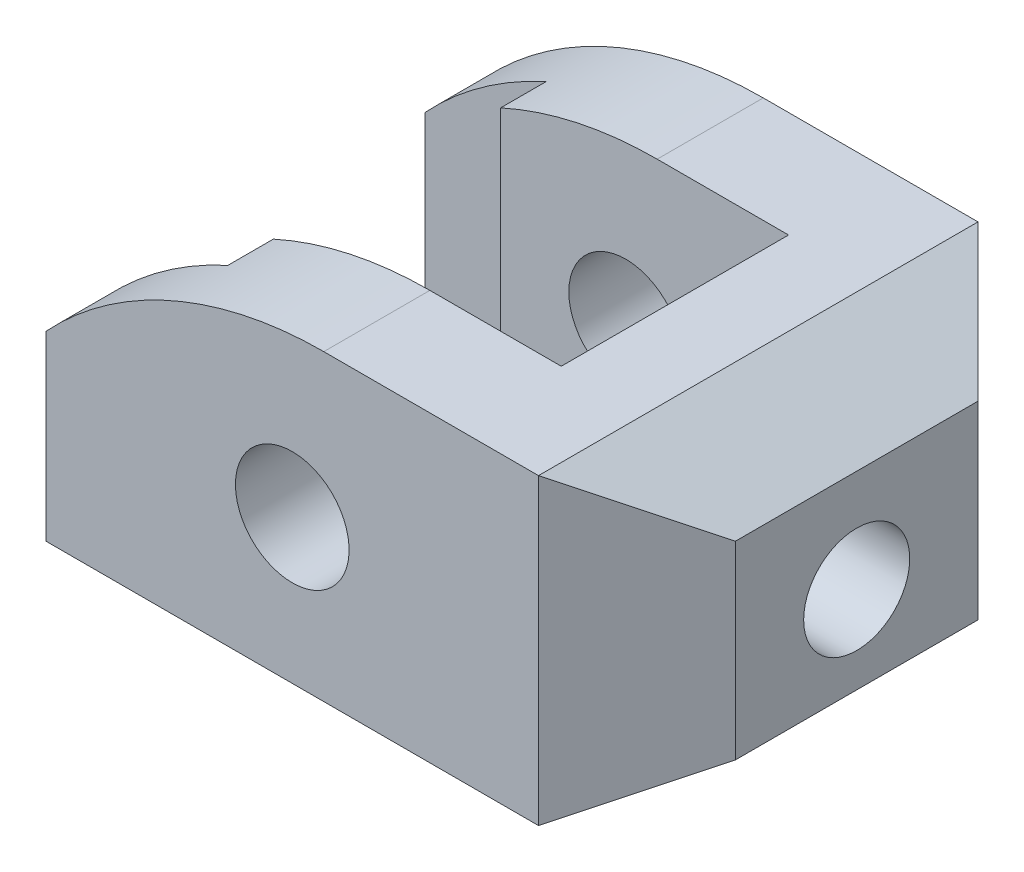
ISO-10303-21;
HEADER;
FILE_DESCRIPTION(('STEP AP214'),'2;1');
FILE_NAME('part.step','',(''),(''),'','','');
FILE_SCHEMA(('AUTOMOTIVE_DESIGN { 1 0 10303 214 1 1 1 1 }'));
ENDSEC;
DATA;
#1=APPLICATION_CONTEXT('core data for automotive mechanical design processes');
#2=APPLICATION_PROTOCOL_DEFINITION('international standard','automotive_design',2000,#1);
#3=PRODUCT_CONTEXT('',#1,'mechanical');
#4=PRODUCT('Part','Part','',(#3));
#5=PRODUCT_RELATED_PRODUCT_CATEGORY('part','',(#4));
#6=PRODUCT_DEFINITION_FORMATION('','',#4);
#7=PRODUCT_DEFINITION_CONTEXT('part definition',#1,'design');
#8=PRODUCT_DEFINITION('design','',#6,#7);
#9=PRODUCT_DEFINITION_SHAPE('','',#8);
#10=(LENGTH_UNIT() NAMED_UNIT(*) SI_UNIT(.MILLI.,.METRE.));
#11=(NAMED_UNIT(*) PLANE_ANGLE_UNIT() SI_UNIT($,.RADIAN.));
#12=(NAMED_UNIT(*) SI_UNIT($,.STERADIAN.) SOLID_ANGLE_UNIT());
#13=UNCERTAINTY_MEASURE_WITH_UNIT(LENGTH_MEASURE(1.E-05),#10,'distance_accuracy_value','');
#14=(GEOMETRIC_REPRESENTATION_CONTEXT(3) GLOBAL_UNCERTAINTY_ASSIGNED_CONTEXT((#13)) GLOBAL_UNIT_ASSIGNED_CONTEXT((#10,
#11,#12)) REPRESENTATION_CONTEXT('',''));
#15=CARTESIAN_POINT('',(0.,0.,0.));
#16=DIRECTION('',(0.,0.,1.));
#17=DIRECTION('',(1.,0.,0.));
#18=AXIS2_PLACEMENT_3D('',#15,#16,#17);
#19=CARTESIAN_POINT('',(4.16060555964673,-29.,58.));
#20=DIRECTION('',(0.,0.,-1.));
#21=DIRECTION('',(-1.,0.,0.));
#22=AXIS2_PLACEMENT_3D('',#19,#20,#21);
#23=CYLINDRICAL_SURFACE('',#22,50.);
#24=DIRECTION('',(0.,0.,-1.));
#25=VECTOR('',#24,1.);
#26=CARTESIAN_POINT('',(-16.5,16.5317403347236,58.));
#27=LINE('',#26,#25);
#28=CARTESIAN_POINT('',(-16.5,16.5317403347236,44.));
#29=VERTEX_POINT('',#28);
#30=CARTESIAN_POINT('',(-16.5,16.5317403347236,50.));
#31=VERTEX_POINT('',#30);
#32=EDGE_CURVE('E274',#29,#31,#27,.F.);
#33=ORIENTED_EDGE('',*,*,#32,.T.);
#34=CARTESIAN_POINT('',(4.16060555964673,-29.,50.));
#35=DIRECTION('',(0.,0.,1.));
#36=DIRECTION('',(1.,0.,0.));
#37=AXIS2_PLACEMENT_3D('',#34,#35,#36);
#38=CIRCLE('',#37,50.);
#39=CARTESIAN_POINT('',(-32.5,4.99999999999999,50.));
#40=VERTEX_POINT('',#39);
#41=EDGE_CURVE('E222',#31,#40,#38,.T.);
#42=ORIENTED_EDGE('',*,*,#41,.T.);
#43=DIRECTION('',(0.,0.,-1.));
#44=VECTOR('',#43,1.);
#45=CARTESIAN_POINT('',(-32.5,5.,58.));
#46=LINE('',#45,#44);
#47=CARTESIAN_POINT('',(-32.5,5.,58.));
#48=VERTEX_POINT('',#47);
#49=EDGE_CURVE('E244',#48,#40,#46,.T.);
#50=ORIENTED_EDGE('',*,*,#49,.F.);
#51=CARTESIAN_POINT('',(4.16060555964673,-29.,58.));
#52=DIRECTION('',(0.,0.,1.));
#53=DIRECTION('',(-1.,0.,0.));
#54=AXIS2_PLACEMENT_3D('',#51,#52,#53);
#55=CIRCLE('',#54,50.);
#56=CARTESIAN_POINT('',(4.16060555964673,21.,58.));
#57=VERTEX_POINT('',#56);
#58=EDGE_CURVE('E241',#57,#48,#55,.T.);
#59=ORIENTED_EDGE('',*,*,#58,.F.);
#60=DIRECTION('',(0.,0.,-1.));
#61=VECTOR('',#60,1.);
#62=CARTESIAN_POINT('',(4.16060555964673,21.,58.));
#63=LINE('',#62,#61);
#64=CARTESIAN_POINT('',(4.16060555964673,21.,44.));
#65=VERTEX_POINT('',#64);
#66=EDGE_CURVE('E218',#57,#65,#63,.T.);
#67=ORIENTED_EDGE('',*,*,#66,.T.);
#68=CARTESIAN_POINT('',(4.16060555964673,-29.,44.));
#69=DIRECTION('',(0.,0.,1.));
#70=DIRECTION('',(1.,0.,0.));
#71=AXIS2_PLACEMENT_3D('',#68,#69,#70);
#72=CIRCLE('',#71,50.);
#73=EDGE_CURVE('E221',#65,#29,#72,.T.);
#74=ORIENTED_EDGE('',*,*,#73,.T.);
#75=EDGE_LOOP('',(#33,#42,#50,#59,#67,#74));
#76=FACE_BOUND('',#75,.T.);
#77=ADVANCED_FACE('F41',(#76),#23,.T.);
#78=CARTESIAN_POINT('',(-32.5,-19.,58.));
#79=DIRECTION('',(1.,0.,0.));
#80=DIRECTION('',(0.,0.,-1.));
#81=AXIS2_PLACEMENT_3D('',#78,#79,#80);
#82=PLANE('',#81);
#83=ORIENTED_EDGE('',*,*,#49,.T.);
#84=DIRECTION('',(0.,1.,0.));
#85=VECTOR('',#84,1.);
#86=CARTESIAN_POINT('',(-32.5,-19.,50.));
#87=LINE('',#86,#85);
#88=CARTESIAN_POINT('',(-32.5,-19.,50.));
#89=VERTEX_POINT('',#88);
#90=EDGE_CURVE('E287',#89,#40,#87,.T.);
#91=ORIENTED_EDGE('',*,*,#90,.F.);
#92=DIRECTION('',(0.,0.,-1.));
#93=VECTOR('',#92,1.);
#94=CARTESIAN_POINT('',(-32.5,-19.,58.));
#95=LINE('',#94,#93);
#96=CARTESIAN_POINT('',(-32.5,-19.,58.));
#97=VERTEX_POINT('',#96);
#98=EDGE_CURVE('E194',#97,#89,#95,.T.);
#99=ORIENTED_EDGE('',*,*,#98,.F.);
#100=DIRECTION('',(0.,-1.,0.));
#101=VECTOR('',#100,1.);
#102=CARTESIAN_POINT('',(-32.5,-19.,58.));
#103=LINE('',#102,#101);
#104=EDGE_CURVE('E239',#48,#97,#103,.T.);
#105=ORIENTED_EDGE('',*,*,#104,.F.);
#106=EDGE_LOOP('',(#83,#91,#99,#105));
#107=FACE_BOUND('',#106,.T.);
#108=ADVANCED_FACE('F332',(#107),#82,.F.);
#109=CARTESIAN_POINT('',(0.,0.,58.));
#110=DIRECTION('',(0.,0.,-1.));
#111=DIRECTION('',(-1.,0.,0.));
#112=AXIS2_PLACEMENT_3D('',#109,#110,#111);
#113=CYLINDRICAL_SURFACE('',#112,7.5);
#114=CARTESIAN_POINT('',(0.,0.,14.));
#115=DIRECTION('',(0.,0.,-1.));
#116=DIRECTION('',(-1.,0.,0.));
#117=AXIS2_PLACEMENT_3D('',#114,#115,#116);
#118=CIRCLE('',#117,7.5);
#119=CARTESIAN_POINT('',(-7.5,0.,14.));
#120=VERTEX_POINT('',#119);
#121=EDGE_CURVE('E262',#120,#120,#118,.T.);
#122=CARTESIAN_POINT('',(0.,0.,0.));
#123=DIRECTION('',(0.,0.,1.));
#124=DIRECTION('',(1.,0.,0.));
#125=AXIS2_PLACEMENT_3D('',#122,#123,#124);
#126=CIRCLE('',#125,7.5);
#127=CARTESIAN_POINT('',(-7.5,0.,0.));
#128=VERTEX_POINT('',#127);
#129=EDGE_CURVE('E236',#128,#128,#126,.T.);
#130=CARTESIAN_POINT('',(-7.5,0.,14.));
#131=CARTESIAN_POINT('',(-7.5,0.,13.8541666666667));
#132=CARTESIAN_POINT('',(-7.5,0.,13.7083333333333));
#133=CARTESIAN_POINT('',(-7.5,0.,13.4166666666667));
#134=CARTESIAN_POINT('',(-7.5,0.,13.2708333333333));
#135=CARTESIAN_POINT('',(-7.5,0.,12.9791666666667));
#136=CARTESIAN_POINT('',(-7.5,0.,12.8333333333333));
#137=CARTESIAN_POINT('',(-7.5,0.,12.5416666666667));
#138=CARTESIAN_POINT('',(-7.5,0.,12.3958333333333));
#139=CARTESIAN_POINT('',(-7.5,0.,12.1041666666667));
#140=CARTESIAN_POINT('',(-7.5,0.,11.9583333333333));
#141=CARTESIAN_POINT('',(-7.5,0.,11.6666666666667));
#142=CARTESIAN_POINT('',(-7.5,0.,11.5208333333333));
#143=CARTESIAN_POINT('',(-7.5,0.,11.2291666666667));
#144=CARTESIAN_POINT('',(-7.5,0.,11.0833333333333));
#145=CARTESIAN_POINT('',(-7.5,0.,10.7916666666667));
#146=CARTESIAN_POINT('',(-7.5,0.,10.6458333333333));
#147=CARTESIAN_POINT('',(-7.5,0.,10.3541666666667));
#148=CARTESIAN_POINT('',(-7.5,0.,10.2083333333333));
#149=CARTESIAN_POINT('',(-7.5,0.,9.91666666666668));
#150=CARTESIAN_POINT('',(-7.5,0.,9.77083333333334));
#151=CARTESIAN_POINT('',(-7.5,0.,9.47916666666667));
#152=CARTESIAN_POINT('',(-7.5,0.,9.33333333333334));
#153=CARTESIAN_POINT('',(-7.5,0.,9.04166666666667));
#154=CARTESIAN_POINT('',(-7.5,0.,8.89583333333334));
#155=CARTESIAN_POINT('',(-7.5,0.,8.60416666666667));
#156=CARTESIAN_POINT('',(-7.5,0.,8.45833333333334));
#157=CARTESIAN_POINT('',(-7.5,0.,8.16666666666667));
#158=CARTESIAN_POINT('',(-7.5,0.,8.02083333333334));
#159=CARTESIAN_POINT('',(-7.5,0.,7.72916666666667));
#160=CARTESIAN_POINT('',(-7.5,0.,7.58333333333334));
#161=CARTESIAN_POINT('',(-7.5,0.,7.29166666666667));
#162=CARTESIAN_POINT('',(-7.5,0.,7.14583333333334));
#163=CARTESIAN_POINT('',(-7.5,0.,6.85416666666667));
#164=CARTESIAN_POINT('',(-7.5,0.,6.70833333333334));
#165=CARTESIAN_POINT('',(-7.5,0.,6.41666666666667));
#166=CARTESIAN_POINT('',(-7.5,0.,6.27083333333334));
#167=CARTESIAN_POINT('',(-7.5,0.,5.97916666666667));
#168=CARTESIAN_POINT('',(-7.5,0.,5.83333333333334));
#169=CARTESIAN_POINT('',(-7.5,0.,5.54166666666667));
#170=CARTESIAN_POINT('',(-7.5,0.,5.39583333333334));
#171=CARTESIAN_POINT('',(-7.5,0.,5.10416666666667));
#172=CARTESIAN_POINT('',(-7.5,0.,4.95833333333334));
#173=CARTESIAN_POINT('',(-7.5,0.,4.66666666666667));
#174=CARTESIAN_POINT('',(-7.5,0.,4.52083333333334));
#175=CARTESIAN_POINT('',(-7.5,0.,4.22916666666667));
#176=CARTESIAN_POINT('',(-7.5,0.,4.08333333333334));
#177=CARTESIAN_POINT('',(-7.5,0.,3.79166666666667));
#178=CARTESIAN_POINT('',(-7.5,0.,3.64583333333334));
#179=CARTESIAN_POINT('',(-7.5,0.,3.35416666666667));
#180=CARTESIAN_POINT('',(-7.5,0.,3.20833333333334));
#181=CARTESIAN_POINT('',(-7.5,0.,2.91666666666667));
#182=CARTESIAN_POINT('',(-7.5,0.,2.77083333333334));
#183=CARTESIAN_POINT('',(-7.5,0.,2.47916666666667));
#184=CARTESIAN_POINT('',(-7.5,0.,2.33333333333334));
#185=CARTESIAN_POINT('',(-7.5,0.,2.04166666666667));
#186=CARTESIAN_POINT('',(-7.5,0.,1.89583333333333));
#187=CARTESIAN_POINT('',(-7.5,0.,1.60416666666667));
#188=CARTESIAN_POINT('',(-7.5,0.,1.45833333333333));
#189=CARTESIAN_POINT('',(-7.5,0.,1.16666666666667));
#190=CARTESIAN_POINT('',(-7.5,0.,1.02083333333333));
#191=CARTESIAN_POINT('',(-7.5,0.,0.729166666666667));
#192=CARTESIAN_POINT('',(-7.5,0.,0.583333333333334));
#193=CARTESIAN_POINT('',(-7.5,0.,0.291666666666667));
#194=CARTESIAN_POINT('',(-7.5,0.,0.145833333333333));
#195=CARTESIAN_POINT('',(-7.5,0.,0.));
#196=B_SPLINE_CURVE_WITH_KNOTS('',3,(#130,#131,#132,#133,#134,#135,#136,#137,#138,#139,#140,
#141,#142,#143,#144,#145,#146,#147,#148,#149,#150,#151,#152,#153,#154,#155,#156,#157,#158,#159,
#160,#161,#162,#163,#164,#165,#166,#167,#168,#169,#170,#171,#172,#173,#174,#175,#176,#177,#178,
#179,#180,#181,#182,#183,#184,#185,#186,#187,#188,#189,#190,#191,#192,#193,#194,#195),
.UNSPECIFIED.,.F.,.F.,(4,2,2,2,2,2,2,2,2,2,2,2,2,2,2,2,2,2,2,2,2,2,2,2,2,2,2,2,2,2,2,2,4),(0.,
0.4375,0.875000000000001,1.3125,1.75,2.1875,2.625,3.0625,3.5,3.9375,4.375,4.8125,5.25,
5.68750000000001,6.12500000000001,6.56250000000001,7.00000000000001,7.43750000000001,
7.87500000000001,8.31250000000001,8.75000000000001,9.18750000000001,9.62500000000001,10.0625,
10.5,10.9375,11.375,11.8125,12.25,12.6875,13.125,13.5625,14.),.UNSPECIFIED.);
#197=EDGE_CURVE('BSEAM328',#120,#128,#196,.T.);
#198=ORIENTED_EDGE('',*,*,#121,.F.);
#199=ORIENTED_EDGE('',*,*,#129,.F.);
#200=ORIENTED_EDGE('',*,*,#197,.T.);
#201=ORIENTED_EDGE('',*,*,#197,.F.);
#202=EDGE_LOOP('',(#198,#200,#199,#201));
#203=FACE_BOUND('',#202,.T.);
#204=ADVANCED_FACE('F328',(#203),#113,.F.);
#205=CARTESIAN_POINT('',(4.16060555964673,-29.,58.));
#206=DIRECTION('',(0.,0.,-1.));
#207=DIRECTION('',(-1.,0.,0.));
#208=AXIS2_PLACEMENT_3D('',#205,#206,#207);
#209=PLANE('',#208);
#210=DIRECTION('',(1.,0.,0.));
#211=VECTOR('',#210,1.);
#212=CARTESIAN_POINT('',(32.5,-19.,58.));
#213=LINE('',#212,#211);
#214=CARTESIAN_POINT('',(32.5,-19.,58.));
#215=VERTEX_POINT('',#214);
#216=EDGE_CURVE('E237',#97,#215,#213,.T.);
#217=ORIENTED_EDGE('',*,*,#216,.T.);
#218=DIRECTION('',(0.,1.,0.));
#219=VECTOR('',#218,1.);
#220=CARTESIAN_POINT('',(32.5,-19.,58.));
#221=LINE('',#220,#219);
#222=CARTESIAN_POINT('',(32.5,21.,58.));
#223=VERTEX_POINT('',#222);
#224=EDGE_CURVE('E182',#215,#223,#221,.T.);
#225=ORIENTED_EDGE('',*,*,#224,.T.);
#226=DIRECTION('',(-1.,0.,0.));
#227=VECTOR('',#226,1.);
#228=CARTESIAN_POINT('',(32.5,21.,58.));
#229=LINE('',#228,#227);
#230=EDGE_CURVE('E234',#223,#57,#229,.T.);
#231=ORIENTED_EDGE('',*,*,#230,.T.);
#232=ORIENTED_EDGE('',*,*,#58,.T.);
#233=ORIENTED_EDGE('',*,*,#104,.T.);
#234=EDGE_LOOP('',(#217,#225,#231,#232,#233));
#235=FACE_BOUND('',#234,.T.);
#236=CARTESIAN_POINT('',(0.,0.,58.));
#237=DIRECTION('',(0.,0.,1.));
#238=DIRECTION('',(1.,0.,0.));
#239=AXIS2_PLACEMENT_3D('',#236,#237,#238);
#240=CIRCLE('',#239,7.5);
#241=CARTESIAN_POINT('',(-7.5,0.,58.));
#242=VERTEX_POINT('',#241);
#243=EDGE_CURVE('E224',#242,#242,#240,.T.);
#244=ORIENTED_EDGE('',*,*,#243,.F.);
#245=EDGE_LOOP('',(#244));
#246=FACE_BOUND('',#245,.T.);
#247=ADVANCED_FACE('F331',(#235,#246),#209,.F.);
#248=CARTESIAN_POINT('',(4.16060555964673,-29.,0.));
#249=DIRECTION('',(0.,0.,-1.));
#250=DIRECTION('',(-1.,0.,0.));
#251=AXIS2_PLACEMENT_3D('',#248,#249,#250);
#252=PLANE('',#251);
#253=DIRECTION('',(0.,1.,0.));
#254=VECTOR('',#253,1.);
#255=CARTESIAN_POINT('',(32.5,-19.,0.));
#256=LINE('',#255,#254);
#257=CARTESIAN_POINT('',(32.5,-19.,0.));
#258=VERTEX_POINT('',#257);
#259=CARTESIAN_POINT('',(32.5,21.,0.));
#260=VERTEX_POINT('',#259);
#261=EDGE_CURVE('E161',#258,#260,#256,.T.);
#262=ORIENTED_EDGE('',*,*,#261,.F.);
#263=DIRECTION('',(1.,0.,0.));
#264=VECTOR('',#263,1.);
#265=CARTESIAN_POINT('',(32.5,-19.,0.));
#266=LINE('',#265,#264);
#267=CARTESIAN_POINT('',(-32.5,-19.,0.));
#268=VERTEX_POINT('',#267);
#269=EDGE_CURVE('E178',#268,#258,#266,.T.);
#270=ORIENTED_EDGE('',*,*,#269,.F.);
#271=DIRECTION('',(0.,-1.,0.));
#272=VECTOR('',#271,1.);
#273=CARTESIAN_POINT('',(-32.5,-19.,0.));
#274=LINE('',#273,#272);
#275=CARTESIAN_POINT('',(-32.5,5.,0.));
#276=VERTEX_POINT('',#275);
#277=EDGE_CURVE('E226',#276,#268,#274,.T.);
#278=ORIENTED_EDGE('',*,*,#277,.F.);
#279=CARTESIAN_POINT('',(4.16060555964673,-29.,0.));
#280=DIRECTION('',(0.,0.,1.));
#281=DIRECTION('',(-1.,0.,0.));
#282=AXIS2_PLACEMENT_3D('',#279,#280,#281);
#283=CIRCLE('',#282,50.);
#284=CARTESIAN_POINT('',(4.16060555964673,21.,0.));
#285=VERTEX_POINT('',#284);
#286=EDGE_CURVE('E230',#285,#276,#283,.T.);
#287=ORIENTED_EDGE('',*,*,#286,.F.);
#288=DIRECTION('',(-1.,0.,0.));
#289=VECTOR('',#288,1.);
#290=CARTESIAN_POINT('',(32.5,21.,0.));
#291=LINE('',#290,#289);
#292=EDGE_CURVE('E181',#260,#285,#291,.T.);
#293=ORIENTED_EDGE('',*,*,#292,.F.);
#294=EDGE_LOOP('',(#262,#270,#278,#287,#293));
#295=FACE_BOUND('',#294,.T.);
#296=ORIENTED_EDGE('',*,*,#129,.T.);
#297=EDGE_LOOP('',(#296));
#298=FACE_BOUND('',#297,.T.);
#299=ADVANCED_FACE('F175',(#295,#298),#252,.T.);
#300=CARTESIAN_POINT('',(4.16060555964673,-29.,8.));
#301=DIRECTION('',(0.,0.,-1.));
#302=DIRECTION('',(-1.,0.,0.));
#303=AXIS2_PLACEMENT_3D('',#300,#301,#302);
#304=CIRCLE('',#303,50.);
#305=CARTESIAN_POINT('',(-32.5,4.99999999999999,8.));
#306=VERTEX_POINT('',#305);
#307=CARTESIAN_POINT('',(-16.5,16.5317403347236,8.));
#308=VERTEX_POINT('',#307);
#309=EDGE_CURVE('E94',#306,#308,#304,.T.);
#310=ORIENTED_EDGE('',*,*,#309,.T.);
#311=DIRECTION('',(0.,0.,-1.));
#312=VECTOR('',#311,1.);
#313=CARTESIAN_POINT('',(-16.5,16.5317403347236,58.));
#314=LINE('',#313,#312);
#315=CARTESIAN_POINT('',(-16.5,16.5317403347236,14.));
#316=VERTEX_POINT('',#315);
#317=EDGE_CURVE('E65',#308,#316,#314,.F.);
#318=ORIENTED_EDGE('',*,*,#317,.T.);
#319=CARTESIAN_POINT('',(4.16060555964673,-29.,14.));
#320=DIRECTION('',(0.,0.,-1.));
#321=DIRECTION('',(-1.,0.,0.));
#322=AXIS2_PLACEMENT_3D('',#319,#320,#321);
#323=CIRCLE('',#322,50.);
#324=CARTESIAN_POINT('',(4.16060555964673,21.,14.));
#325=VERTEX_POINT('',#324);
#326=EDGE_CURVE('E250',#316,#325,#323,.T.);
#327=ORIENTED_EDGE('',*,*,#326,.T.);
#328=EDGE_CURVE('E223',#325,#285,#63,.T.);
#329=ORIENTED_EDGE('',*,*,#328,.T.);
#330=ORIENTED_EDGE('',*,*,#286,.T.);
#331=EDGE_CURVE('E229',#306,#276,#46,.T.);
#332=ORIENTED_EDGE('',*,*,#331,.F.);
#333=EDGE_LOOP('',(#310,#318,#327,#329,#330,#332));
#334=FACE_BOUND('',#333,.T.);
#335=ADVANCED_FACE('F43',(#334),#23,.T.);
#336=CARTESIAN_POINT('',(-32.5,-19.,8.));
#337=VERTEX_POINT('',#336);
#338=EDGE_CURVE('E192',#337,#268,#95,.T.);
#339=ORIENTED_EDGE('',*,*,#338,.F.);
#340=DIRECTION('',(0.,1.,0.));
#341=VECTOR('',#340,1.);
#342=CARTESIAN_POINT('',(-32.5,-19.,8.));
#343=LINE('',#342,#341);
#344=EDGE_CURVE('E233',#337,#306,#343,.T.);
#345=ORIENTED_EDGE('',*,*,#344,.T.);
#346=ORIENTED_EDGE('',*,*,#331,.T.);
#347=ORIENTED_EDGE('',*,*,#277,.T.);
#348=EDGE_LOOP('',(#339,#345,#346,#347));
#349=FACE_BOUND('',#348,.T.);
#350=ADVANCED_FACE('F343',(#349),#82,.F.);
#351=CARTESIAN_POINT('',(32.5,-19.,58.));
#352=DIRECTION('',(0.,1.,0.));
#353=DIRECTION('',(-1.,0.,0.));
#354=AXIS2_PLACEMENT_3D('',#351,#352,#353);
#355=PLANE('',#354);
#356=DIRECTION('',(-1.,0.,0.));
#357=VECTOR('',#356,1.);
#358=CARTESIAN_POINT('',(21.5,-19.,14.));
#359=LINE('',#358,#357);
#360=CARTESIAN_POINT('',(21.5,-19.,14.));
#361=VERTEX_POINT('',#360);
#362=CARTESIAN_POINT('',(-16.5,-19.,14.));
#363=VERTEX_POINT('',#362);
#364=EDGE_CURVE('E228',#361,#363,#359,.T.);
#365=ORIENTED_EDGE('',*,*,#364,.T.);
#366=DIRECTION('',(0.,0.,-1.));
#367=VECTOR('',#366,1.);
#368=CARTESIAN_POINT('',(-16.5,-19.,14.));
#369=LINE('',#368,#367);
#370=CARTESIAN_POINT('',(-16.5,-19.,8.));
#371=VERTEX_POINT('',#370);
#372=EDGE_CURVE('E266',#363,#371,#369,.T.);
#373=ORIENTED_EDGE('',*,*,#372,.T.);
#374=DIRECTION('',(-1.,0.,0.));
#375=VECTOR('',#374,1.);
#376=CARTESIAN_POINT('',(-16.5,-19.,8.));
#377=LINE('',#376,#375);
#378=EDGE_CURVE('E294',#371,#337,#377,.T.);
#379=ORIENTED_EDGE('',*,*,#378,.T.);
#380=ORIENTED_EDGE('',*,*,#338,.T.);
#381=ORIENTED_EDGE('',*,*,#269,.T.);
#382=DIRECTION('',(0.,0.,-1.));
#383=VECTOR('',#382,1.);
#384=CARTESIAN_POINT('',(32.5,-19.,58.));
#385=LINE('',#384,#383);
#386=EDGE_CURVE('E189',#215,#258,#385,.T.);
#387=ORIENTED_EDGE('',*,*,#386,.F.);
#388=ORIENTED_EDGE('',*,*,#216,.F.);
#389=ORIENTED_EDGE('',*,*,#98,.T.);
#390=DIRECTION('',(1.,0.,0.));
#391=VECTOR('',#390,1.);
#392=CARTESIAN_POINT('',(-16.5,-19.,50.));
#393=LINE('',#392,#391);
#394=CARTESIAN_POINT('',(-16.5,-19.,50.));
#395=VERTEX_POINT('',#394);
#396=EDGE_CURVE('E281',#89,#395,#393,.T.);
#397=ORIENTED_EDGE('',*,*,#396,.T.);
#398=DIRECTION('',(0.,0.,-1.));
#399=VECTOR('',#398,1.);
#400=CARTESIAN_POINT('',(-16.5,-19.,44.));
#401=LINE('',#400,#399);
#402=CARTESIAN_POINT('',(-16.5,-19.,44.));
#403=VERTEX_POINT('',#402);
#404=EDGE_CURVE('E270',#395,#403,#401,.T.);
#405=ORIENTED_EDGE('',*,*,#404,.T.);
#406=DIRECTION('',(1.,0.,0.));
#407=VECTOR('',#406,1.);
#408=CARTESIAN_POINT('',(21.5,-19.,44.));
#409=LINE('',#408,#407);
#410=CARTESIAN_POINT('',(21.5,-19.,44.));
#411=VERTEX_POINT('',#410);
#412=EDGE_CURVE('E205',#403,#411,#409,.T.);
#413=ORIENTED_EDGE('',*,*,#412,.T.);
#414=DIRECTION('',(0.,0.,-1.));
#415=VECTOR('',#414,1.);
#416=CARTESIAN_POINT('',(21.5,-19.,44.));
#417=LINE('',#416,#415);
#418=EDGE_CURVE('E200',#411,#361,#417,.T.);
#419=ORIENTED_EDGE('',*,*,#418,.T.);
#420=EDGE_LOOP('',(#365,#373,#379,#380,#381,#387,#388,#389,#397,#405,#413,#419));
#421=FACE_BOUND('',#420,.T.);
#422=ADVANCED_FACE('F187',(#421),#355,.F.);
#423=CARTESIAN_POINT('',(32.5,-19.,58.));
#424=DIRECTION('',(-0.500000000000001,0.866025403784438,0.));
#425=DIRECTION('',(-0.866025403784438,-0.500000000000001,0.));
#426=AXIS2_PLACEMENT_3D('',#423,#424,#425);
#427=PLANE('',#426);
#428=ORIENTED_EDGE('',*,*,#386,.T.);
#429=DIRECTION('',(0.654653670707976,0.377964473009228,0.654653670707978));
#430=VECTOR('',#429,1.);
#431=CARTESIAN_POINT('',(57.3571428571428,-4.64872188014355,24.857142857143));
#432=LINE('',#431,#430);
#433=CARTESIAN_POINT('',(45.4903810567666,-11.5,12.9903810567667));
#434=VERTEX_POINT('',#433);
#435=EDGE_CURVE('E158',#258,#434,#432,.T.);
#436=ORIENTED_EDGE('',*,*,#435,.T.);
#437=DIRECTION('',(0.,0.,-1.));
#438=VECTOR('',#437,1.);
#439=CARTESIAN_POINT('',(45.4903810567666,-11.5,58.));
#440=LINE('',#439,#438);
#441=CARTESIAN_POINT('',(45.4903810567666,-11.5,45.0096189432334));
#442=VERTEX_POINT('',#441);
#443=EDGE_CURVE('E199',#442,#434,#440,.T.);
#444=ORIENTED_EDGE('',*,*,#443,.F.);
#445=DIRECTION('',(-0.654653670707976,-0.377964473009228,0.654653670707978));
#446=VECTOR('',#445,1.);
#447=CARTESIAN_POINT('',(32.5,-19.,58.));
#448=LINE('',#447,#446);
#449=EDGE_CURVE('E169',#442,#215,#448,.T.);
#450=ORIENTED_EDGE('',*,*,#449,.T.);
#451=EDGE_LOOP('',(#428,#436,#444,#450));
#452=FACE_BOUND('',#451,.T.);
#453=ADVANCED_FACE('F197',(#452),#427,.F.);
#454=CARTESIAN_POINT('',(45.4903810567666,-11.5,58.));
#455=DIRECTION('',(-1.,0.,0.));
#456=DIRECTION('',(0.,0.,1.));
#457=AXIS2_PLACEMENT_3D('',#454,#455,#456);
#458=PLANE('',#457);
#459=CARTESIAN_POINT('',(45.4903810567666,0.,29.));
#460=DIRECTION('',(-1.,0.,0.));
#461=DIRECTION('',(0.,0.,1.));
#462=AXIS2_PLACEMENT_3D('',#459,#460,#461);
#463=CIRCLE('',#462,7.);
#464=CARTESIAN_POINT('',(45.4903810567666,0.,36.));
#465=VERTEX_POINT('',#464);
#466=EDGE_CURVE('E278',#465,#465,#463,.T.);
#467=ORIENTED_EDGE('',*,*,#466,.T.);
#468=EDGE_LOOP('',(#467));
#469=FACE_BOUND('',#468,.T.);
#470=ORIENTED_EDGE('',*,*,#443,.T.);
#471=DIRECTION('',(0.,1.,0.));
#472=VECTOR('',#471,1.);
#473=CARTESIAN_POINT('',(45.4903810567666,-19.,12.9903810567667));
#474=LINE('',#473,#472);
#475=CARTESIAN_POINT('',(45.4903810567666,13.5000000000001,12.9903810567667));
#476=VERTEX_POINT('',#475);
#477=EDGE_CURVE('E163',#434,#476,#474,.T.);
#478=ORIENTED_EDGE('',*,*,#477,.T.);
#479=DIRECTION('',(0.,0.,-1.));
#480=VECTOR('',#479,1.);
#481=CARTESIAN_POINT('',(45.4903810567666,13.5000000000001,58.));
#482=LINE('',#481,#480);
#483=CARTESIAN_POINT('',(45.4903810567666,13.5000000000001,45.0096189432334));
#484=VERTEX_POINT('',#483);
#485=EDGE_CURVE('E202',#484,#476,#482,.T.);
#486=ORIENTED_EDGE('',*,*,#485,.F.);
#487=DIRECTION('',(0.,1.,0.));
#488=VECTOR('',#487,1.);
#489=CARTESIAN_POINT('',(45.4903810567666,-19.,45.0096189432334));
#490=LINE('',#489,#488);
#491=EDGE_CURVE('E56',#442,#484,#490,.T.);
#492=ORIENTED_EDGE('',*,*,#491,.F.);
#493=EDGE_LOOP('',(#470,#478,#486,#492));
#494=FACE_BOUND('',#493,.T.);
#495=ADVANCED_FACE('F313',(#469,#494),#458,.F.);
#496=CARTESIAN_POINT('',(45.4903810567666,13.5000000000001,58.));
#497=DIRECTION('',(-0.499999999999995,-0.866025403784442,0.));
#498=DIRECTION('',(0.866025403784442,-0.499999999999995,0.));
#499=AXIS2_PLACEMENT_3D('',#496,#497,#498);
#500=PLANE('',#499);
#501=ORIENTED_EDGE('',*,*,#485,.T.);
#502=DIRECTION('',(-0.654653670707978,0.377964473009222,-0.65465367070798));
#503=VECTOR('',#502,1.);
#504=CARTESIAN_POINT('',(64.7802177467238,2.36300759442952,32.280217746724));
#505=LINE('',#504,#503);
#506=EDGE_CURVE('E11',#476,#260,#505,.T.);
#507=ORIENTED_EDGE('',*,*,#506,.T.);
#508=DIRECTION('',(0.,0.,-1.));
#509=VECTOR('',#508,1.);
#510=CARTESIAN_POINT('',(32.5,21.,58.));
#511=LINE('',#510,#509);
#512=EDGE_CURVE('E214',#223,#260,#511,.T.);
#513=ORIENTED_EDGE('',*,*,#512,.F.);
#514=DIRECTION('',(0.654653670707978,-0.377964473009222,-0.65465367070798));
#515=VECTOR('',#514,1.);
#516=CARTESIAN_POINT('',(39.9230748895808,16.7142857142858,50.5769251104191));
#517=LINE('',#516,#515);
#518=EDGE_CURVE('E49',#223,#484,#517,.T.);
#519=ORIENTED_EDGE('',*,*,#518,.T.);
#520=EDGE_LOOP('',(#501,#507,#513,#519));
#521=FACE_BOUND('',#520,.T.);
#522=ADVANCED_FACE('F309',(#521),#500,.F.);
#523=CARTESIAN_POINT('',(32.5,21.,58.));
#524=DIRECTION('',(0.,-1.,0.));
#525=DIRECTION('',(1.,0.,0.));
#526=AXIS2_PLACEMENT_3D('',#523,#524,#525);
#527=PLANE('',#526);
#528=ORIENTED_EDGE('',*,*,#328,.F.);
#529=DIRECTION('',(1.,0.,0.));
#530=VECTOR('',#529,1.);
#531=CARTESIAN_POINT('',(32.4999999999999,21.,14.));
#532=LINE('',#531,#530);
#533=CARTESIAN_POINT('',(21.5,21.,14.));
#534=VERTEX_POINT('',#533);
#535=EDGE_CURVE('E213',#325,#534,#532,.T.);
#536=ORIENTED_EDGE('',*,*,#535,.T.);
#537=DIRECTION('',(0.,0.,1.));
#538=VECTOR('',#537,1.);
#539=CARTESIAN_POINT('',(21.5,21.,58.));
#540=LINE('',#539,#538);
#541=CARTESIAN_POINT('',(21.5,21.,44.));
#542=VERTEX_POINT('',#541);
#543=EDGE_CURVE('E255',#534,#542,#540,.T.);
#544=ORIENTED_EDGE('',*,*,#543,.T.);
#545=DIRECTION('',(-1.,0.,0.));
#546=VECTOR('',#545,1.);
#547=CARTESIAN_POINT('',(32.5,21.,44.));
#548=LINE('',#547,#546);
#549=EDGE_CURVE('E217',#542,#65,#548,.T.);
#550=ORIENTED_EDGE('',*,*,#549,.T.);
#551=ORIENTED_EDGE('',*,*,#66,.F.);
#552=ORIENTED_EDGE('',*,*,#230,.F.);
#553=ORIENTED_EDGE('',*,*,#512,.T.);
#554=ORIENTED_EDGE('',*,*,#292,.T.);
#555=EDGE_LOOP('',(#528,#536,#544,#550,#551,#552,#553,#554));
#556=FACE_BOUND('',#555,.T.);
#557=ADVANCED_FACE('F371',(#556),#527,.F.);
#558=CARTESIAN_POINT('',(0.,0.,44.));
#559=DIRECTION('',(0.,0.,1.));
#560=DIRECTION('',(1.,0.,0.));
#561=AXIS2_PLACEMENT_3D('',#558,#559,#560);
#562=CIRCLE('',#561,7.5);
#563=CARTESIAN_POINT('',(-7.5,0.,44.));
#564=VERTEX_POINT('',#563);
#565=EDGE_CURVE('E208',#564,#564,#562,.T.);
#566=CARTESIAN_POINT('',(-7.5,0.,44.));
#567=CARTESIAN_POINT('',(-7.5,0.,44.1458333333333));
#568=CARTESIAN_POINT('',(-7.5,0.,44.2916666666667));
#569=CARTESIAN_POINT('',(-7.5,0.,44.5833333333333));
#570=CARTESIAN_POINT('',(-7.5,0.,44.7291666666667));
#571=CARTESIAN_POINT('',(-7.5,0.,45.0208333333333));
#572=CARTESIAN_POINT('',(-7.5,0.,45.1666666666667));
#573=CARTESIAN_POINT('',(-7.5,0.,45.4583333333333));
#574=CARTESIAN_POINT('',(-7.5,0.,45.6041666666667));
#575=CARTESIAN_POINT('',(-7.5,0.,45.8958333333333));
#576=CARTESIAN_POINT('',(-7.5,0.,46.0416666666667));
#577=CARTESIAN_POINT('',(-7.5,0.,46.3333333333333));
#578=CARTESIAN_POINT('',(-7.5,0.,46.4791666666667));
#579=CARTESIAN_POINT('',(-7.5,0.,46.7708333333333));
#580=CARTESIAN_POINT('',(-7.5,0.,46.9166666666667));
#581=CARTESIAN_POINT('',(-7.5,0.,47.2083333333333));
#582=CARTESIAN_POINT('',(-7.5,0.,47.3541666666667));
#583=CARTESIAN_POINT('',(-7.5,0.,47.6458333333333));
#584=CARTESIAN_POINT('',(-7.5,0.,47.7916666666667));
#585=CARTESIAN_POINT('',(-7.5,0.,48.0833333333333));
#586=CARTESIAN_POINT('',(-7.5,0.,48.2291666666667));
#587=CARTESIAN_POINT('',(-7.5,0.,48.5208333333333));
#588=CARTESIAN_POINT('',(-7.5,0.,48.6666666666667));
#589=CARTESIAN_POINT('',(-7.5,0.,48.9583333333333));
#590=CARTESIAN_POINT('',(-7.5,0.,49.1041666666667));
#591=CARTESIAN_POINT('',(-7.5,0.,49.3958333333333));
#592=CARTESIAN_POINT('',(-7.5,0.,49.5416666666667));
#593=CARTESIAN_POINT('',(-7.5,0.,49.8333333333333));
#594=CARTESIAN_POINT('',(-7.5,0.,49.9791666666667));
#595=CARTESIAN_POINT('',(-7.5,0.,50.2708333333333));
#596=CARTESIAN_POINT('',(-7.5,0.,50.4166666666667));
#597=CARTESIAN_POINT('',(-7.5,0.,50.7083333333333));
#598=CARTESIAN_POINT('',(-7.5,0.,50.8541666666667));
#599=CARTESIAN_POINT('',(-7.5,0.,51.1458333333333));
#600=CARTESIAN_POINT('',(-7.5,0.,51.2916666666667));
#601=CARTESIAN_POINT('',(-7.5,0.,51.5833333333333));
#602=CARTESIAN_POINT('',(-7.5,0.,51.7291666666667));
#603=CARTESIAN_POINT('',(-7.5,0.,52.0208333333333));
#604=CARTESIAN_POINT('',(-7.5,0.,52.1666666666667));
#605=CARTESIAN_POINT('',(-7.5,0.,52.4583333333333));
#606=CARTESIAN_POINT('',(-7.5,0.,52.6041666666667));
#607=CARTESIAN_POINT('',(-7.5,0.,52.8958333333333));
#608=CARTESIAN_POINT('',(-7.5,0.,53.0416666666667));
#609=CARTESIAN_POINT('',(-7.5,0.,53.3333333333333));
#610=CARTESIAN_POINT('',(-7.5,0.,53.4791666666667));
#611=CARTESIAN_POINT('',(-7.5,0.,53.7708333333333));
#612=CARTESIAN_POINT('',(-7.5,0.,53.9166666666667));
#613=CARTESIAN_POINT('',(-7.5,0.,54.2083333333333));
#614=CARTESIAN_POINT('',(-7.5,0.,54.3541666666667));
#615=CARTESIAN_POINT('',(-7.5,0.,54.6458333333333));
#616=CARTESIAN_POINT('',(-7.5,0.,54.7916666666667));
#617=CARTESIAN_POINT('',(-7.5,0.,55.0833333333333));
#618=CARTESIAN_POINT('',(-7.5,0.,55.2291666666667));
#619=CARTESIAN_POINT('',(-7.5,0.,55.5208333333333));
#620=CARTESIAN_POINT('',(-7.5,0.,55.6666666666667));
#621=CARTESIAN_POINT('',(-7.5,0.,55.9583333333333));
#622=CARTESIAN_POINT('',(-7.5,0.,56.1041666666667));
#623=CARTESIAN_POINT('',(-7.5,0.,56.3958333333333));
#624=CARTESIAN_POINT('',(-7.5,0.,56.5416666666667));
#625=CARTESIAN_POINT('',(-7.5,0.,56.8333333333333));
#626=CARTESIAN_POINT('',(-7.5,0.,56.9791666666667));
#627=CARTESIAN_POINT('',(-7.5,0.,57.2708333333333));
#628=CARTESIAN_POINT('',(-7.5,0.,57.4166666666667));
#629=CARTESIAN_POINT('',(-7.5,0.,57.7083333333333));
#630=CARTESIAN_POINT('',(-7.5,0.,57.8541666666667));
#631=CARTESIAN_POINT('',(-7.5,0.,58.));
#632=B_SPLINE_CURVE_WITH_KNOTS('',3,(#566,#567,#568,#569,#570,#571,#572,#573,#574,#575,#576,
#577,#578,#579,#580,#581,#582,#583,#584,#585,#586,#587,#588,#589,#590,#591,#592,#593,#594,#595,
#596,#597,#598,#599,#600,#601,#602,#603,#604,#605,#606,#607,#608,#609,#610,#611,#612,#613,#614,
#615,#616,#617,#618,#619,#620,#621,#622,#623,#624,#625,#626,#627,#628,#629,#630,#631),
.UNSPECIFIED.,.F.,.F.,(4,2,2,2,2,2,2,2,2,2,2,2,2,2,2,2,2,2,2,2,2,2,2,2,2,2,2,2,2,2,2,2,4),(0.,
0.4375,0.874999999999994,1.31249999999999,1.74999999999999,2.1875,2.625,3.0625,3.5,3.9375,4.375,
4.81249999999999,5.24999999999999,5.68749999999999,6.12499999999999,6.56249999999999,
6.99999999999999,7.43749999999999,7.87499999999999,8.31249999999999,8.74999999999999,
9.18749999999999,9.62499999999999,10.0625,10.5,10.9375,11.375,11.8125,12.25,12.6875,13.125,
13.5625,14.),.UNSPECIFIED.);
#633=EDGE_CURVE('BSEAM334',#564,#242,#632,.T.);
#634=ORIENTED_EDGE('',*,*,#565,.F.);
#635=ORIENTED_EDGE('',*,*,#243,.T.);
#636=ORIENTED_EDGE('',*,*,#633,.T.);
#637=ORIENTED_EDGE('',*,*,#633,.F.);
#638=EDGE_LOOP('',(#634,#636,#635,#637));
#639=FACE_BOUND('',#638,.T.);
#640=ADVANCED_FACE('F334',(#639),#113,.F.);
#641=CARTESIAN_POINT('',(21.5,-19.,44.));
#642=DIRECTION('',(1.,0.,0.));
#643=DIRECTION('',(0.,1.,0.));
#644=AXIS2_PLACEMENT_3D('',#641,#642,#643);
#645=PLANE('',#644);
#646=CARTESIAN_POINT('',(21.5,0.,29.));
#647=DIRECTION('',(1.,0.,0.));
#648=DIRECTION('',(0.,1.,0.));
#649=AXIS2_PLACEMENT_3D('',#646,#647,#648);
#650=CIRCLE('',#649,7.);
#651=CARTESIAN_POINT('',(21.5,7.,29.));
#652=VERTEX_POINT('',#651);
#653=EDGE_CURVE('E168',#652,#652,#650,.T.);
#654=ORIENTED_EDGE('',*,*,#653,.T.);
#655=EDGE_LOOP('',(#654));
#656=FACE_BOUND('',#655,.T.);
#657=DIRECTION('',(0.,1.,0.));
#658=VECTOR('',#657,1.);
#659=CARTESIAN_POINT('',(21.5,-19.,14.));
#660=LINE('',#659,#658);
#661=EDGE_CURVE('E263',#361,#534,#660,.T.);
#662=ORIENTED_EDGE('',*,*,#661,.F.);
#663=ORIENTED_EDGE('',*,*,#418,.F.);
#664=DIRECTION('',(0.,1.,0.));
#665=VECTOR('',#664,1.);
#666=CARTESIAN_POINT('',(21.5,-19.,44.));
#667=LINE('',#666,#665);
#668=EDGE_CURVE('E249',#411,#542,#667,.T.);
#669=ORIENTED_EDGE('',*,*,#668,.T.);
#670=ORIENTED_EDGE('',*,*,#543,.F.);
#671=EDGE_LOOP('',(#662,#663,#669,#670));
#672=FACE_BOUND('',#671,.T.);
#673=ADVANCED_FACE('F373',(#656,#672),#645,.F.);
#674=CARTESIAN_POINT('',(21.5,-19.,14.));
#675=DIRECTION('',(0.,0.,-1.));
#676=DIRECTION('',(-1.,0.,0.));
#677=AXIS2_PLACEMENT_3D('',#674,#675,#676);
#678=PLANE('',#677);
#679=ORIENTED_EDGE('',*,*,#121,.T.);
#680=EDGE_LOOP('',(#679));
#681=FACE_BOUND('',#680,.T.);
#682=DIRECTION('',(0.,1.,0.));
#683=VECTOR('',#682,1.);
#684=CARTESIAN_POINT('',(-16.5,-19.,14.));
#685=LINE('',#684,#683);
#686=EDGE_CURVE('E292',#363,#316,#685,.T.);
#687=ORIENTED_EDGE('',*,*,#686,.F.);
#688=ORIENTED_EDGE('',*,*,#364,.F.);
#689=ORIENTED_EDGE('',*,*,#661,.T.);
#690=ORIENTED_EDGE('',*,*,#535,.F.);
#691=ORIENTED_EDGE('',*,*,#326,.F.);
#692=EDGE_LOOP('',(#687,#688,#689,#690,#691));
#693=FACE_BOUND('',#692,.T.);
#694=ADVANCED_FACE('F325',(#681,#693),#678,.F.);
#695=CARTESIAN_POINT('',(21.5,-19.,44.));
#696=DIRECTION('',(0.,0.,1.));
#697=DIRECTION('',(1.,0.,0.));
#698=AXIS2_PLACEMENT_3D('',#695,#696,#697);
#699=PLANE('',#698);
#700=ORIENTED_EDGE('',*,*,#565,.T.);
#701=EDGE_LOOP('',(#700));
#702=FACE_BOUND('',#701,.T.);
#703=ORIENTED_EDGE('',*,*,#549,.F.);
#704=ORIENTED_EDGE('',*,*,#668,.F.);
#705=ORIENTED_EDGE('',*,*,#412,.F.);
#706=DIRECTION('',(0.,1.,0.));
#707=VECTOR('',#706,1.);
#708=CARTESIAN_POINT('',(-16.5,-19.,44.));
#709=LINE('',#708,#707);
#710=EDGE_CURVE('E288',#403,#29,#709,.T.);
#711=ORIENTED_EDGE('',*,*,#710,.T.);
#712=ORIENTED_EDGE('',*,*,#73,.F.);
#713=EDGE_LOOP('',(#703,#704,#705,#711,#712));
#714=FACE_BOUND('',#713,.T.);
#715=ADVANCED_FACE('F360',(#702,#714),#699,.F.);
#716=CARTESIAN_POINT('',(-16.5,-19.,44.));
#717=DIRECTION('',(1.,0.,0.));
#718=DIRECTION('',(0.,1.,0.));
#719=AXIS2_PLACEMENT_3D('',#716,#717,#718);
#720=PLANE('',#719);
#721=ORIENTED_EDGE('',*,*,#710,.F.);
#722=ORIENTED_EDGE('',*,*,#404,.F.);
#723=DIRECTION('',(0.,1.,0.));
#724=VECTOR('',#723,1.);
#725=CARTESIAN_POINT('',(-16.5,-19.,50.));
#726=LINE('',#725,#724);
#727=EDGE_CURVE('E284',#395,#31,#726,.T.);
#728=ORIENTED_EDGE('',*,*,#727,.T.);
#729=ORIENTED_EDGE('',*,*,#32,.F.);
#730=EDGE_LOOP('',(#721,#722,#728,#729));
#731=FACE_BOUND('',#730,.T.);
#732=ADVANCED_FACE('F356',(#731),#720,.F.);
#733=CARTESIAN_POINT('',(-16.5,-19.,50.));
#734=DIRECTION('',(0.,0.,1.));
#735=DIRECTION('',(1.,0.,0.));
#736=AXIS2_PLACEMENT_3D('',#733,#734,#735);
#737=PLANE('',#736);
#738=ORIENTED_EDGE('',*,*,#727,.F.);
#739=ORIENTED_EDGE('',*,*,#396,.F.);
#740=ORIENTED_EDGE('',*,*,#90,.T.);
#741=ORIENTED_EDGE('',*,*,#41,.F.);
#742=EDGE_LOOP('',(#738,#739,#740,#741));
#743=FACE_BOUND('',#742,.T.);
#744=ADVANCED_FACE('F365',(#743),#737,.F.);
#745=CARTESIAN_POINT('',(-16.5,-19.,8.));
#746=DIRECTION('',(0.,0.,-1.));
#747=DIRECTION('',(-1.,0.,0.));
#748=AXIS2_PLACEMENT_3D('',#745,#746,#747);
#749=PLANE('',#748);
#750=ORIENTED_EDGE('',*,*,#344,.F.);
#751=ORIENTED_EDGE('',*,*,#378,.F.);
#752=DIRECTION('',(0.,1.,0.));
#753=VECTOR('',#752,1.);
#754=CARTESIAN_POINT('',(-16.5,-19.,8.));
#755=LINE('',#754,#753);
#756=EDGE_CURVE('E88',#371,#308,#755,.T.);
#757=ORIENTED_EDGE('',*,*,#756,.T.);
#758=ORIENTED_EDGE('',*,*,#309,.F.);
#759=EDGE_LOOP('',(#750,#751,#757,#758));
#760=FACE_BOUND('',#759,.T.);
#761=ADVANCED_FACE('F380',(#760),#749,.F.);
#762=CARTESIAN_POINT('',(-16.5,-19.,14.));
#763=DIRECTION('',(1.,0.,0.));
#764=DIRECTION('',(0.,1.,0.));
#765=AXIS2_PLACEMENT_3D('',#762,#763,#764);
#766=PLANE('',#765);
#767=ORIENTED_EDGE('',*,*,#756,.F.);
#768=ORIENTED_EDGE('',*,*,#372,.F.);
#769=ORIENTED_EDGE('',*,*,#686,.T.);
#770=ORIENTED_EDGE('',*,*,#317,.F.);
#771=EDGE_LOOP('',(#767,#768,#769,#770));
#772=FACE_BOUND('',#771,.T.);
#773=ADVANCED_FACE('F377',(#772),#766,.F.);
#774=CARTESIAN_POINT('',(-32.5,0.,29.));
#775=DIRECTION('',(1.,0.,0.));
#776=DIRECTION('',(0.,0.,-1.));
#777=AXIS2_PLACEMENT_3D('',#774,#775,#776);
#778=CYLINDRICAL_SURFACE('',#777,7.);
#779=ORIENTED_EDGE('',*,*,#653,.F.);
#780=EDGE_LOOP('',(#779));
#781=FACE_BOUND('',#780,.T.);
#782=ORIENTED_EDGE('',*,*,#466,.F.);
#783=EDGE_LOOP('',(#782));
#784=FACE_BOUND('',#783,.T.);
#785=ADVANCED_FACE('F379',(#781,#784),#778,.F.);
#786=CARTESIAN_POINT('',(32.5,-19.,58.));
#787=DIRECTION('',(-0.707106781186549,0.,-0.707106781186546));
#788=DIRECTION('',(-0.707106781186546,0.,0.707106781186549));
#789=AXIS2_PLACEMENT_3D('',#786,#787,#788);
#790=PLANE('',#789);
#791=ORIENTED_EDGE('',*,*,#491,.T.);
#792=ORIENTED_EDGE('',*,*,#518,.F.);
#793=ORIENTED_EDGE('',*,*,#224,.F.);
#794=ORIENTED_EDGE('',*,*,#449,.F.);
#795=EDGE_LOOP('',(#791,#792,#793,#794));
#796=FACE_BOUND('',#795,.T.);
#797=ADVANCED_FACE('F387',(#796),#790,.F.);
#798=CARTESIAN_POINT('',(32.5,-19.,0.));
#799=DIRECTION('',(-0.707106781186549,0.,0.707106781186546));
#800=DIRECTION('',(0.707106781186546,0.,0.707106781186549));
#801=AXIS2_PLACEMENT_3D('',#798,#799,#800);
#802=PLANE('',#801);
#803=ORIENTED_EDGE('',*,*,#261,.T.);
#804=ORIENTED_EDGE('',*,*,#506,.F.);
#805=ORIENTED_EDGE('',*,*,#477,.F.);
#806=ORIENTED_EDGE('',*,*,#435,.F.);
#807=EDGE_LOOP('',(#803,#804,#805,#806));
#808=FACE_BOUND('',#807,.T.);
#809=ADVANCED_FACE('F160',(#808),#802,.F.);
#810=CLOSED_SHELL('',(#77,#108,#204,#247,#299,#335,#350,#422,#453,#495,#522,#557,#640,#673,#694,
#715,#732,#744,#761,#773,#785,#797,#809));
#811=MANIFOLD_SOLID_BREP('B2',#810);
#812=ADVANCED_BREP_SHAPE_REPRESENTATION('',(#18,#811),#14);
#813=SHAPE_DEFINITION_REPRESENTATION(#9,#812);
ENDSEC;
END-ISO-10303-21;
